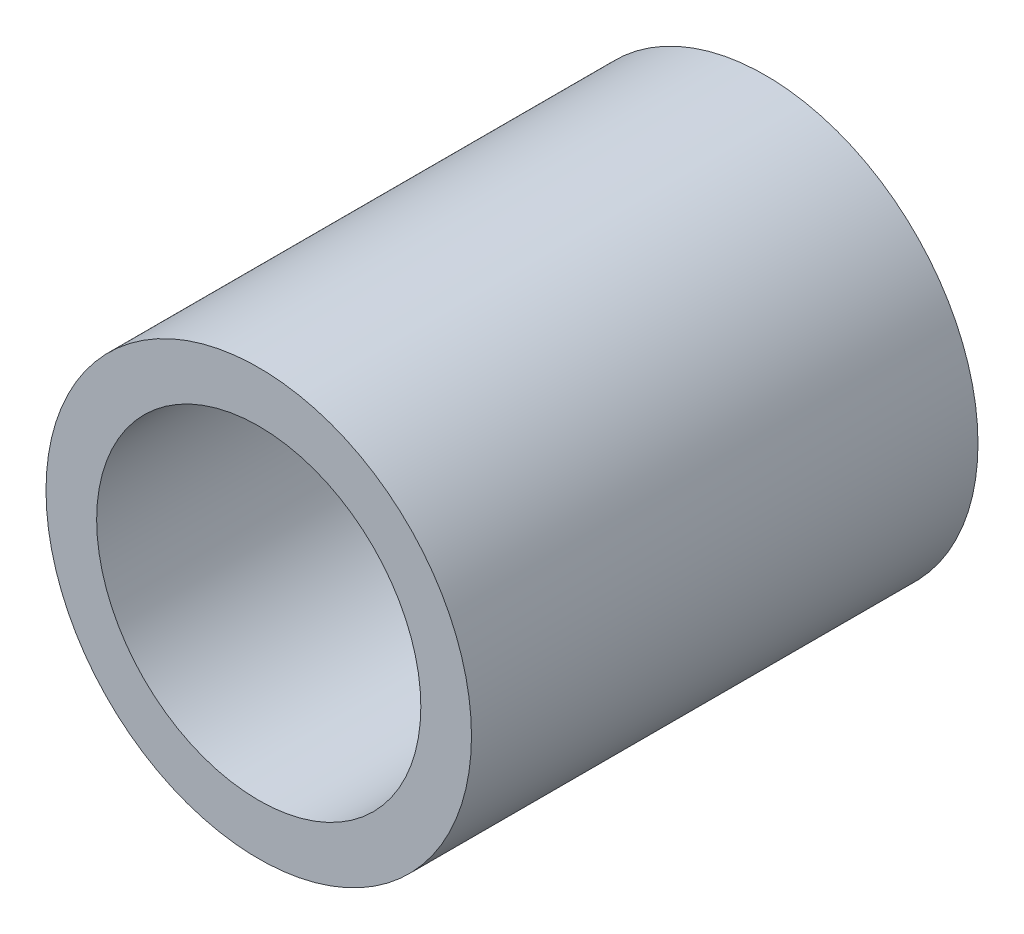
ISO-10303-21;
HEADER;
FILE_DESCRIPTION(('STEP AP214'),'2;1');
FILE_NAME('part.step','',(''),(''),'','','');
FILE_SCHEMA(('AUTOMOTIVE_DESIGN { 1 0 10303 214 1 1 1 1 }'));
ENDSEC;
DATA;
#1=APPLICATION_CONTEXT('core data for automotive mechanical design processes');
#2=APPLICATION_PROTOCOL_DEFINITION('international standard','automotive_design',2000,#1);
#3=PRODUCT_CONTEXT('',#1,'mechanical');
#4=PRODUCT('Part','Part','',(#3));
#5=PRODUCT_RELATED_PRODUCT_CATEGORY('part','',(#4));
#6=PRODUCT_DEFINITION_FORMATION('','',#4);
#7=PRODUCT_DEFINITION_CONTEXT('part definition',#1,'design');
#8=PRODUCT_DEFINITION('design','',#6,#7);
#9=PRODUCT_DEFINITION_SHAPE('','',#8);
#10=(LENGTH_UNIT() NAMED_UNIT(*) SI_UNIT(.MILLI.,.METRE.));
#11=(NAMED_UNIT(*) PLANE_ANGLE_UNIT() SI_UNIT($,.RADIAN.));
#12=(NAMED_UNIT(*) SI_UNIT($,.STERADIAN.) SOLID_ANGLE_UNIT());
#13=UNCERTAINTY_MEASURE_WITH_UNIT(LENGTH_MEASURE(1.E-05),#10,'distance_accuracy_value','');
#14=(GEOMETRIC_REPRESENTATION_CONTEXT(3) GLOBAL_UNCERTAINTY_ASSIGNED_CONTEXT((#13)) GLOBAL_UNIT_ASSIGNED_CONTEXT((#10,
#11,#12)) REPRESENTATION_CONTEXT('',''));
#15=CARTESIAN_POINT('',(0.,0.,0.));
#16=DIRECTION('',(0.,0.,1.));
#17=DIRECTION('',(1.,0.,0.));
#18=AXIS2_PLACEMENT_3D('',#15,#16,#17);
#19=CARTESIAN_POINT('',(0.,0.,5.));
#20=DIRECTION('',(0.,0.,-1.));
#21=DIRECTION('',(-1.,0.,0.));
#22=AXIS2_PLACEMENT_3D('',#19,#20,#21);
#23=CYLINDRICAL_SURFACE('',#22,2.1);
#24=CARTESIAN_POINT('',(0.,0.,5.));
#25=DIRECTION('',(0.,0.,1.));
#26=DIRECTION('',(1.,0.,0.));
#27=AXIS2_PLACEMENT_3D('',#24,#25,#26);
#28=CIRCLE('',#27,2.1);
#29=CARTESIAN_POINT('',(2.1,0.,5.));
#30=VERTEX_POINT('',#29);
#31=EDGE_CURVE('E10',#30,#30,#28,.T.);
#32=ORIENTED_EDGE('',*,*,#31,.F.);
#33=EDGE_LOOP('',(#32));
#34=FACE_BOUND('',#33,.T.);
#35=CARTESIAN_POINT('',(0.,0.,0.));
#36=DIRECTION('',(0.,0.,1.));
#37=DIRECTION('',(1.,0.,0.));
#38=AXIS2_PLACEMENT_3D('',#35,#36,#37);
#39=CIRCLE('',#38,2.1);
#40=CARTESIAN_POINT('',(2.1,0.,0.));
#41=VERTEX_POINT('',#40);
#42=EDGE_CURVE('E35',#41,#41,#39,.T.);
#43=ORIENTED_EDGE('',*,*,#42,.T.);
#44=EDGE_LOOP('',(#43));
#45=FACE_BOUND('',#44,.T.);
#46=ADVANCED_FACE('F32',(#34,#45),#23,.T.);
#47=CARTESIAN_POINT('',(0.,0.,5.));
#48=DIRECTION('',(0.,0.,1.));
#49=DIRECTION('',(1.,0.,0.));
#50=AXIS2_PLACEMENT_3D('',#47,#48,#49);
#51=PLANE('',#50);
#52=CARTESIAN_POINT('',(0.,0.,5.));
#53=DIRECTION('',(0.,0.,1.));
#54=DIRECTION('',(1.,0.,0.));
#55=AXIS2_PLACEMENT_3D('',#52,#53,#54);
#56=CIRCLE('',#55,1.6);
#57=CARTESIAN_POINT('',(1.6,0.,5.));
#58=VERTEX_POINT('',#57);
#59=EDGE_CURVE('E42',#58,#58,#56,.T.);
#60=ORIENTED_EDGE('',*,*,#59,.F.);
#61=EDGE_LOOP('',(#60));
#62=FACE_BOUND('',#61,.T.);
#63=ORIENTED_EDGE('',*,*,#31,.T.);
#64=EDGE_LOOP('',(#63));
#65=FACE_BOUND('',#64,.T.);
#66=ADVANCED_FACE('F53',(#62,#65),#51,.T.);
#67=CARTESIAN_POINT('',(0.,0.,0.));
#68=DIRECTION('',(0.,0.,1.));
#69=DIRECTION('',(1.,0.,0.));
#70=AXIS2_PLACEMENT_3D('',#67,#68,#69);
#71=PLANE('',#70);
#72=CARTESIAN_POINT('',(0.,0.,0.));
#73=DIRECTION('',(0.,0.,1.));
#74=DIRECTION('',(1.,0.,0.));
#75=AXIS2_PLACEMENT_3D('',#72,#73,#74);
#76=CIRCLE('',#75,1.6);
#77=CARTESIAN_POINT('',(1.6,0.,0.));
#78=VERTEX_POINT('',#77);
#79=EDGE_CURVE('E44',#78,#78,#76,.T.);
#80=ORIENTED_EDGE('',*,*,#79,.T.);
#81=EDGE_LOOP('',(#80));
#82=FACE_BOUND('',#81,.T.);
#83=ORIENTED_EDGE('',*,*,#42,.F.);
#84=EDGE_LOOP('',(#83));
#85=FACE_BOUND('',#84,.T.);
#86=ADVANCED_FACE('F55',(#82,#85),#71,.F.);
#87=CARTESIAN_POINT('',(0.,0.,5.));
#88=DIRECTION('',(0.,0.,-1.));
#89=DIRECTION('',(-1.,0.,0.));
#90=AXIS2_PLACEMENT_3D('',#87,#88,#89);
#91=CYLINDRICAL_SURFACE('',#90,1.6);
#92=ORIENTED_EDGE('',*,*,#59,.T.);
#93=EDGE_LOOP('',(#92));
#94=FACE_BOUND('',#93,.T.);
#95=ORIENTED_EDGE('',*,*,#79,.F.);
#96=EDGE_LOOP('',(#95));
#97=FACE_BOUND('',#96,.T.);
#98=ADVANCED_FACE('F50',(#94,#97),#91,.F.);
#99=CLOSED_SHELL('',(#46,#66,#86,#98));
#100=MANIFOLD_SOLID_BREP('B2',#99);
#101=ADVANCED_BREP_SHAPE_REPRESENTATION('',(#18,#100),#14);
#102=SHAPE_DEFINITION_REPRESENTATION(#9,#101);
ENDSEC;
END-ISO-10303-21;
